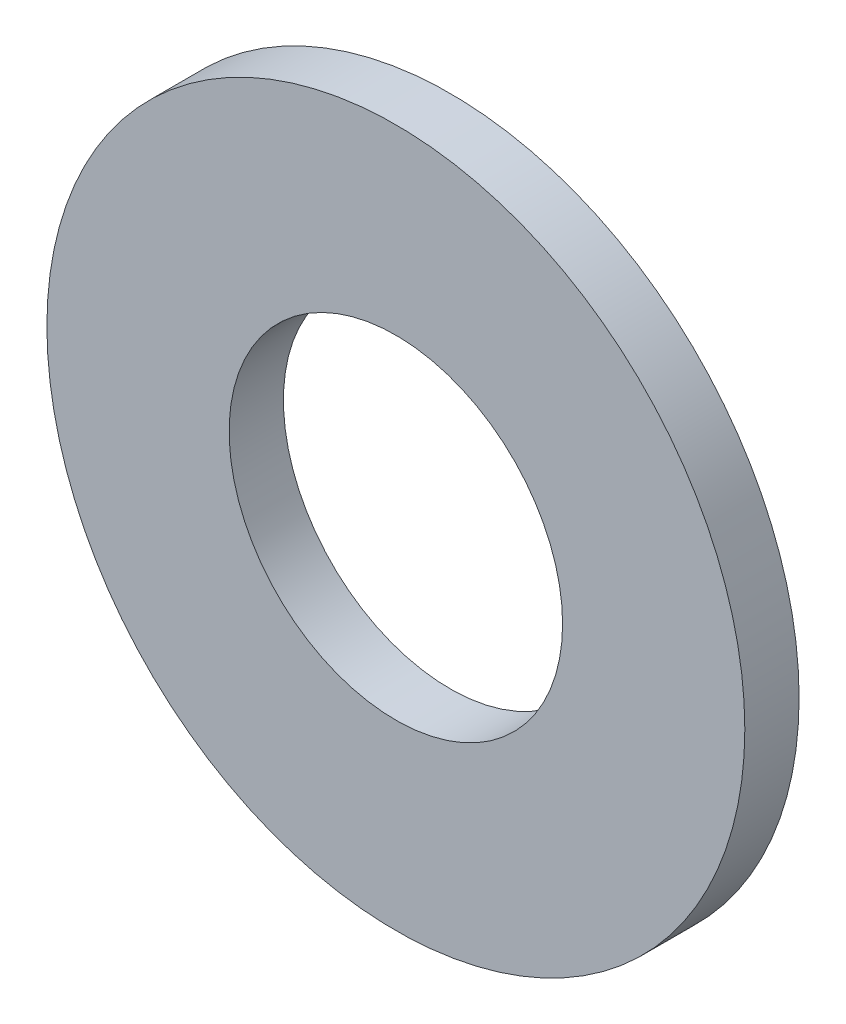
ISO-10303-21;
HEADER;
FILE_DESCRIPTION(('STEP AP214'),'2;1');
FILE_NAME('part.step','',(''),(''),'','','');
FILE_SCHEMA(('AUTOMOTIVE_DESIGN { 1 0 10303 214 1 1 1 1 }'));
ENDSEC;
DATA;
#1=APPLICATION_CONTEXT('core data for automotive mechanical design processes');
#2=APPLICATION_PROTOCOL_DEFINITION('international standard','automotive_design',2000,#1);
#3=PRODUCT_CONTEXT('',#1,'mechanical');
#4=PRODUCT('Part','Part','',(#3));
#5=PRODUCT_RELATED_PRODUCT_CATEGORY('part','',(#4));
#6=PRODUCT_DEFINITION_FORMATION('','',#4);
#7=PRODUCT_DEFINITION_CONTEXT('part definition',#1,'design');
#8=PRODUCT_DEFINITION('design','',#6,#7);
#9=PRODUCT_DEFINITION_SHAPE('','',#8);
#10=(LENGTH_UNIT() NAMED_UNIT(*) SI_UNIT(.MILLI.,.METRE.));
#11=(NAMED_UNIT(*) PLANE_ANGLE_UNIT() SI_UNIT($,.RADIAN.));
#12=(NAMED_UNIT(*) SI_UNIT($,.STERADIAN.) SOLID_ANGLE_UNIT());
#13=UNCERTAINTY_MEASURE_WITH_UNIT(LENGTH_MEASURE(1.E-05),#10,'distance_accuracy_value','');
#14=(GEOMETRIC_REPRESENTATION_CONTEXT(3) GLOBAL_UNCERTAINTY_ASSIGNED_CONTEXT((#13)) GLOBAL_UNIT_ASSIGNED_CONTEXT((#10,
#11,#12)) REPRESENTATION_CONTEXT('',''));
#15=CARTESIAN_POINT('',(0.,0.,0.));
#16=DIRECTION('',(0.,0.,1.));
#17=DIRECTION('',(1.,0.,0.));
#18=AXIS2_PLACEMENT_3D('',#15,#16,#17);
#19=CARTESIAN_POINT('',(0.,0.,-0.7));
#20=DIRECTION('',(0.,0.,1.));
#21=DIRECTION('',(1.,0.,0.));
#22=AXIS2_PLACEMENT_3D('',#19,#20,#21);
#23=CYLINDRICAL_SURFACE('',#22,4.5);
#24=CARTESIAN_POINT('',(0.,0.,-0.7));
#25=DIRECTION('',(0.,0.,1.));
#26=DIRECTION('',(1.,0.,0.));
#27=AXIS2_PLACEMENT_3D('',#24,#25,#26);
#28=CIRCLE('',#27,4.5);
#29=CARTESIAN_POINT('',(4.5,0.,-0.7));
#30=VERTEX_POINT('',#29);
#31=EDGE_CURVE('E10',#30,#30,#28,.T.);
#32=ORIENTED_EDGE('',*,*,#31,.T.);
#33=EDGE_LOOP('',(#32));
#34=FACE_BOUND('',#33,.T.);
#35=CARTESIAN_POINT('',(0.,0.,0.));
#36=DIRECTION('',(0.,0.,1.));
#37=DIRECTION('',(1.,0.,0.));
#38=AXIS2_PLACEMENT_3D('',#35,#36,#37);
#39=CIRCLE('',#38,4.5);
#40=CARTESIAN_POINT('',(4.5,0.,0.));
#41=VERTEX_POINT('',#40);
#42=EDGE_CURVE('E31',#41,#41,#39,.T.);
#43=ORIENTED_EDGE('',*,*,#42,.F.);
#44=EDGE_LOOP('',(#43));
#45=FACE_BOUND('',#44,.T.);
#46=ADVANCED_FACE('F28',(#34,#45),#23,.T.);
#47=CARTESIAN_POINT('',(0.,0.,-0.7));
#48=DIRECTION('',(0.,0.,1.));
#49=DIRECTION('',(1.,0.,0.));
#50=AXIS2_PLACEMENT_3D('',#47,#48,#49);
#51=PLANE('',#50);
#52=CARTESIAN_POINT('',(0.,0.,-0.7));
#53=DIRECTION('',(0.,0.,1.));
#54=DIRECTION('',(1.,0.,0.));
#55=AXIS2_PLACEMENT_3D('',#52,#53,#54);
#56=CIRCLE('',#55,2.15);
#57=CARTESIAN_POINT('',(2.15,0.,-0.7));
#58=VERTEX_POINT('',#57);
#59=EDGE_CURVE('E38',#58,#58,#56,.T.);
#60=ORIENTED_EDGE('',*,*,#59,.T.);
#61=EDGE_LOOP('',(#60));
#62=FACE_BOUND('',#61,.T.);
#63=ORIENTED_EDGE('',*,*,#31,.F.);
#64=EDGE_LOOP('',(#63));
#65=FACE_BOUND('',#64,.T.);
#66=ADVANCED_FACE('F46',(#62,#65),#51,.F.);
#67=CARTESIAN_POINT('',(0.,0.,0.));
#68=DIRECTION('',(0.,0.,1.));
#69=DIRECTION('',(1.,0.,0.));
#70=AXIS2_PLACEMENT_3D('',#67,#68,#69);
#71=PLANE('',#70);
#72=CARTESIAN_POINT('',(0.,0.,0.));
#73=DIRECTION('',(0.,0.,1.));
#74=DIRECTION('',(1.,0.,0.));
#75=AXIS2_PLACEMENT_3D('',#72,#73,#74);
#76=CIRCLE('',#75,2.15);
#77=CARTESIAN_POINT('',(2.15,0.,0.));
#78=VERTEX_POINT('',#77);
#79=EDGE_CURVE('E40',#78,#78,#76,.T.);
#80=ORIENTED_EDGE('',*,*,#79,.F.);
#81=EDGE_LOOP('',(#80));
#82=FACE_BOUND('',#81,.T.);
#83=ORIENTED_EDGE('',*,*,#42,.T.);
#84=EDGE_LOOP('',(#83));
#85=FACE_BOUND('',#84,.T.);
#86=ADVANCED_FACE('F52',(#82,#85),#71,.T.);
#87=CARTESIAN_POINT('',(0.,0.,-0.7));
#88=DIRECTION('',(0.,0.,1.));
#89=DIRECTION('',(1.,0.,0.));
#90=AXIS2_PLACEMENT_3D('',#87,#88,#89);
#91=CYLINDRICAL_SURFACE('',#90,2.15);
#92=ORIENTED_EDGE('',*,*,#59,.F.);
#93=EDGE_LOOP('',(#92));
#94=FACE_BOUND('',#93,.T.);
#95=ORIENTED_EDGE('',*,*,#79,.T.);
#96=EDGE_LOOP('',(#95));
#97=FACE_BOUND('',#96,.T.);
#98=ADVANCED_FACE('F49',(#94,#97),#91,.F.);
#99=CLOSED_SHELL('',(#46,#66,#86,#98));
#100=MANIFOLD_SOLID_BREP('B2',#99);
#101=ADVANCED_BREP_SHAPE_REPRESENTATION('',(#18,#100),#14);
#102=SHAPE_DEFINITION_REPRESENTATION(#9,#101);
ENDSEC;
END-ISO-10303-21;
